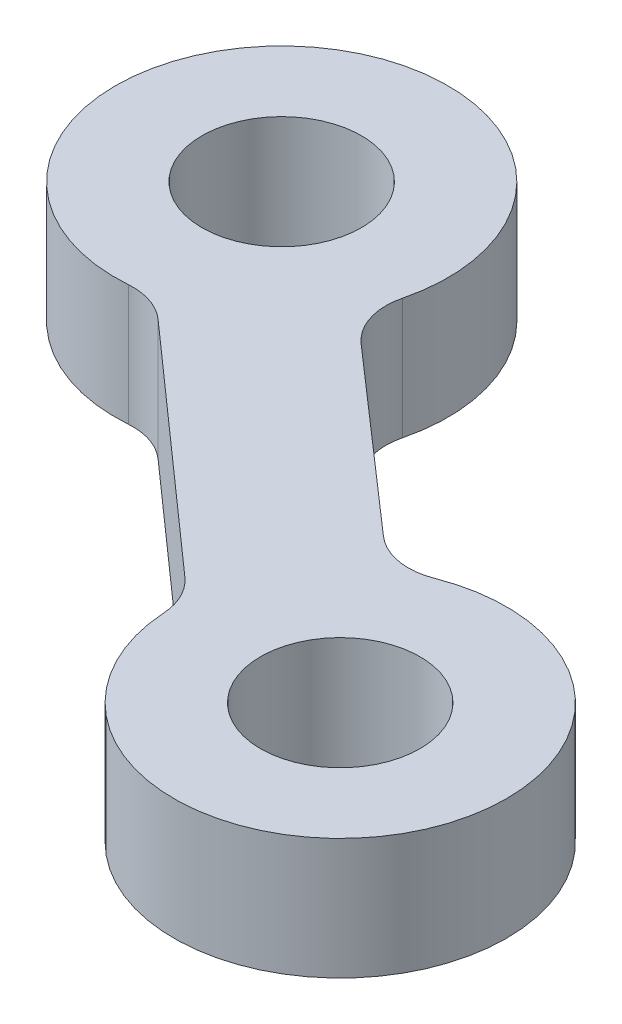
ISO-10303-21;
HEADER;
FILE_DESCRIPTION(('STEP AP214'),'2;1');
FILE_NAME('part.step','',(''),(''),'','','');
FILE_SCHEMA(('AUTOMOTIVE_DESIGN { 1 0 10303 214 1 1 1 1 }'));
ENDSEC;
DATA;
#1=APPLICATION_CONTEXT('core data for automotive mechanical design processes');
#2=APPLICATION_PROTOCOL_DEFINITION('international standard','automotive_design',2000,#1);
#3=PRODUCT_CONTEXT('',#1,'mechanical');
#4=PRODUCT('Part','Part','',(#3));
#5=PRODUCT_RELATED_PRODUCT_CATEGORY('part','',(#4));
#6=PRODUCT_DEFINITION_FORMATION('','',#4);
#7=PRODUCT_DEFINITION_CONTEXT('part definition',#1,'design');
#8=PRODUCT_DEFINITION('design','',#6,#7);
#9=PRODUCT_DEFINITION_SHAPE('','',#8);
#10=(LENGTH_UNIT() NAMED_UNIT(*) SI_UNIT(.MILLI.,.METRE.));
#11=(NAMED_UNIT(*) PLANE_ANGLE_UNIT() SI_UNIT($,.RADIAN.));
#12=(NAMED_UNIT(*) SI_UNIT($,.STERADIAN.) SOLID_ANGLE_UNIT());
#13=UNCERTAINTY_MEASURE_WITH_UNIT(LENGTH_MEASURE(1.E-05),#10,'distance_accuracy_value','');
#14=(GEOMETRIC_REPRESENTATION_CONTEXT(3) GLOBAL_UNCERTAINTY_ASSIGNED_CONTEXT((#13)) GLOBAL_UNIT_ASSIGNED_CONTEXT((#10,
#11,#12)) REPRESENTATION_CONTEXT('',''));
#15=CARTESIAN_POINT('',(0.,0.,0.));
#16=DIRECTION('',(0.,0.,1.));
#17=DIRECTION('',(1.,0.,0.));
#18=AXIS2_PLACEMENT_3D('',#15,#16,#17);
#19=CARTESIAN_POINT('',(97.9868806190565,4.,-33.5833584269257));
#20=DIRECTION('',(0.,-1.,0.));
#21=DIRECTION('',(0.,0.,-1.));
#22=AXIS2_PLACEMENT_3D('',#19,#20,#21);
#23=CYLINDRICAL_SURFACE('',#22,5.50000000000001);
#24=CARTESIAN_POINT('',(97.9868806190565,0.,-33.5833584269257));
#25=DIRECTION('',(0.,-1.,0.));
#26=DIRECTION('',(0.,0.,-1.));
#27=AXIS2_PLACEMENT_3D('',#24,#25,#26);
#28=CIRCLE('',#27,5.50000000000001);
#29=CARTESIAN_POINT('',(95.9828217037036,0.,-38.7052475182468));
#30=VERTEX_POINT('',#29);
#31=CARTESIAN_POINT('',(92.4979516243383,0.,-33.2345626543851));
#32=VERTEX_POINT('',#31);
#33=EDGE_CURVE('E129',#30,#32,#28,.T.);
#34=ORIENTED_EDGE('',*,*,#33,.F.);
#35=DIRECTION('',(0.,-1.,0.));
#36=VECTOR('',#35,1.);
#37=CARTESIAN_POINT('',(95.9828217037036,4.,-38.7052475182468));
#38=LINE('',#37,#36);
#39=CARTESIAN_POINT('',(95.9828217037036,4.,-38.7052475182468));
#40=VERTEX_POINT('',#39);
#41=EDGE_CURVE('E11',#40,#30,#38,.T.);
#42=ORIENTED_EDGE('',*,*,#41,.F.);
#43=CARTESIAN_POINT('',(97.9868806190565,4.,-33.5833584269257));
#44=DIRECTION('',(0.,-1.,0.));
#45=DIRECTION('',(0.,0.,-1.));
#46=AXIS2_PLACEMENT_3D('',#43,#44,#45);
#47=CIRCLE('',#46,5.50000000000001);
#48=CARTESIAN_POINT('',(92.4979516243383,4.,-33.2345626543851));
#49=VERTEX_POINT('',#48);
#50=EDGE_CURVE('E150',#40,#49,#47,.T.);
#51=ORIENTED_EDGE('',*,*,#50,.T.);
#52=DIRECTION('',(0.,-1.,0.));
#53=VECTOR('',#52,1.);
#54=CARTESIAN_POINT('',(92.4979516243383,4.,-33.2345626543851));
#55=LINE('',#54,#53);
#56=EDGE_CURVE('E35',#49,#32,#55,.T.);
#57=ORIENTED_EDGE('',*,*,#56,.T.);
#58=EDGE_LOOP('',(#34,#42,#51,#57));
#59=FACE_BOUND('',#58,.T.);
#60=ADVANCED_FACE('F32',(#59),#23,.T.);
#61=CARTESIAN_POINT('',(95.2540730072116,4.,-40.5677526423636));
#62=DIRECTION('',(0.,-1.,0.));
#63=DIRECTION('',(0.,0.,-1.));
#64=AXIS2_PLACEMENT_3D('',#61,#62,#63);
#65=CYLINDRICAL_SURFACE('',#64,2.00000000000001);
#66=CARTESIAN_POINT('',(95.2540730072116,0.,-40.5677526423636));
#67=DIRECTION('',(0.,1.,0.));
#68=DIRECTION('',(0.,0.,1.));
#69=AXIS2_PLACEMENT_3D('',#66,#67,#68);
#70=CIRCLE('',#69,2.00000000000001);
#71=CARTESIAN_POINT('',(93.9374818242984,0.,-39.0622335767005));
#72=VERTEX_POINT('',#71);
#73=EDGE_CURVE('E148',#72,#30,#70,.T.);
#74=ORIENTED_EDGE('',*,*,#73,.F.);
#75=DIRECTION('',(0.,-1.,0.));
#76=VECTOR('',#75,1.);
#77=CARTESIAN_POINT('',(93.9374818242984,4.,-39.0622335767005));
#78=LINE('',#77,#76);
#79=CARTESIAN_POINT('',(93.9374818242984,4.,-39.0622335767005));
#80=VERTEX_POINT('',#79);
#81=EDGE_CURVE('E41',#80,#72,#78,.T.);
#82=ORIENTED_EDGE('',*,*,#81,.F.);
#83=CARTESIAN_POINT('',(95.2540730072116,4.,-40.5677526423636));
#84=DIRECTION('',(0.,1.,0.));
#85=DIRECTION('',(0.,0.,1.));
#86=AXIS2_PLACEMENT_3D('',#83,#84,#85);
#87=CIRCLE('',#86,2.00000000000001);
#88=EDGE_CURVE('E119',#80,#40,#87,.T.);
#89=ORIENTED_EDGE('',*,*,#88,.T.);
#90=ORIENTED_EDGE('',*,*,#41,.T.);
#91=EDGE_LOOP('',(#74,#82,#89,#90));
#92=FACE_BOUND('',#91,.T.);
#93=ADVANCED_FACE('F162',(#92),#65,.F.);
#94=CARTESIAN_POINT('',(88.0534392912902,4.,-44.2078864585077));
#95=DIRECTION('',(0.658295591456619,0.,-0.752759532831555));
#96=DIRECTION('',(-0.752759532831555,0.,-0.658295591456619));
#97=AXIS2_PLACEMENT_3D('',#94,#95,#96);
#98=PLANE('',#97);
#99=DIRECTION('',(0.752759532831555,0.,0.658295591456619));
#100=VECTOR('',#99,1.);
#101=CARTESIAN_POINT('',(88.0534392912902,0.,-44.2078864585077));
#102=LINE('',#101,#100);
#103=CARTESIAN_POINT('',(88.0534392912902,0.,-44.2078864585077));
#104=VERTEX_POINT('',#103);
#105=EDGE_CURVE('E106',#104,#72,#102,.T.);
#106=ORIENTED_EDGE('',*,*,#105,.F.);
#107=DIRECTION('',(0.,-1.,0.));
#108=VECTOR('',#107,1.);
#109=CARTESIAN_POINT('',(88.0534392912902,4.,-44.2078864585077));
#110=LINE('',#109,#108);
#111=CARTESIAN_POINT('',(88.0534392912902,4.,-44.2078864585077));
#112=VERTEX_POINT('',#111);
#113=EDGE_CURVE('E101',#112,#104,#110,.T.);
#114=ORIENTED_EDGE('',*,*,#113,.F.);
#115=DIRECTION('',(0.752759532831555,0.,0.658295591456619));
#116=VECTOR('',#115,1.);
#117=CARTESIAN_POINT('',(88.0534392912902,4.,-44.2078864585077));
#118=LINE('',#117,#116);
#119=EDGE_CURVE('E104',#112,#80,#118,.T.);
#120=ORIENTED_EDGE('',*,*,#119,.T.);
#121=ORIENTED_EDGE('',*,*,#81,.T.);
#122=EDGE_LOOP('',(#106,#114,#120,#121));
#123=FACE_BOUND('',#122,.T.);
#124=ADVANCED_FACE('F103',(#123),#98,.T.);
#125=CARTESIAN_POINT('',(89.3700304742034,4.,-45.7134055241708));
#126=DIRECTION('',(0.,-1.,0.));
#127=DIRECTION('',(0.,0.,-1.));
#128=AXIS2_PLACEMENT_3D('',#125,#126,#127);
#129=CYLINDRICAL_SURFACE('',#128,2.);
#130=CARTESIAN_POINT('',(89.3700304742034,0.,-45.7134055241708));
#131=DIRECTION('',(0.,1.,0.));
#132=DIRECTION('',(0.,0.,1.));
#133=AXIS2_PLACEMENT_3D('',#130,#131,#132);
#134=CIRCLE('',#133,2.);
#135=CARTESIAN_POINT('',(87.4301696317101,0.,-46.2001702638152));
#136=VERTEX_POINT('',#135);
#137=EDGE_CURVE('E145',#136,#104,#134,.T.);
#138=ORIENTED_EDGE('',*,*,#137,.F.);
#139=DIRECTION('',(0.,-1.,0.));
#140=VECTOR('',#139,1.);
#141=CARTESIAN_POINT('',(87.4301696317101,4.,-46.2001702638152));
#142=LINE('',#141,#140);
#143=CARTESIAN_POINT('',(87.4301696317101,4.,-46.2001702638152));
#144=VERTEX_POINT('',#143);
#145=EDGE_CURVE('E111',#144,#136,#142,.T.);
#146=ORIENTED_EDGE('',*,*,#145,.F.);
#147=CARTESIAN_POINT('',(89.3700304742034,4.,-45.7134055241708));
#148=DIRECTION('',(0.,1.,0.));
#149=DIRECTION('',(0.,0.,1.));
#150=AXIS2_PLACEMENT_3D('',#147,#148,#149);
#151=CIRCLE('',#150,2.);
#152=EDGE_CURVE('E117',#144,#112,#151,.T.);
#153=ORIENTED_EDGE('',*,*,#152,.T.);
#154=ORIENTED_EDGE('',*,*,#113,.T.);
#155=EDGE_LOOP('',(#138,#146,#153,#154));
#156=FACE_BOUND('',#155,.T.);
#157=ADVANCED_FACE('F121',(#156),#129,.F.);
#158=CARTESIAN_POINT('',(82.0955523148534,4.,-47.5387732978373));
#159=DIRECTION('',(0.,-1.,0.));
#160=DIRECTION('',(0.,0.,-1.));
#161=AXIS2_PLACEMENT_3D('',#158,#159,#160);
#162=CYLINDRICAL_SURFACE('',#161,5.50000000000001);
#163=CARTESIAN_POINT('',(82.0955523148534,0.,-47.5387732978373));
#164=DIRECTION('',(0.,-1.,0.));
#165=DIRECTION('',(0.,0.,-1.));
#166=AXIS2_PLACEMENT_3D('',#163,#164,#165);
#167=CIRCLE('',#166,5.50000000000001);
#168=CARTESIAN_POINT('',(82.5101698124519,0.,-42.0544235341292));
#169=VERTEX_POINT('',#168);
#170=EDGE_CURVE('E142',#169,#136,#167,.T.);
#171=ORIENTED_EDGE('',*,*,#170,.F.);
#172=DIRECTION('',(0.,-1.,0.));
#173=VECTOR('',#172,1.);
#174=CARTESIAN_POINT('',(82.5101698124519,4.,-42.0544235341292));
#175=LINE('',#174,#173);
#176=CARTESIAN_POINT('',(82.5101698124519,4.,-42.0544235341292));
#177=VERTEX_POINT('',#176);
#178=EDGE_CURVE('E154',#177,#169,#175,.T.);
#179=ORIENTED_EDGE('',*,*,#178,.F.);
#180=CARTESIAN_POINT('',(82.0955523148534,4.,-47.5387732978373));
#181=DIRECTION('',(0.,-1.,0.));
#182=DIRECTION('',(0.,0.,-1.));
#183=AXIS2_PLACEMENT_3D('',#180,#181,#182);
#184=CIRCLE('',#183,5.50000000000001);
#185=EDGE_CURVE('E122',#177,#144,#184,.T.);
#186=ORIENTED_EDGE('',*,*,#185,.T.);
#187=ORIENTED_EDGE('',*,*,#145,.T.);
#188=EDGE_LOOP('',(#171,#179,#186,#187));
#189=FACE_BOUND('',#188,.T.);
#190=ADVANCED_FACE('F175',(#189),#162,.T.);
#191=CARTESIAN_POINT('',(82.6609398115787,4.,-40.0601145291444));
#192=DIRECTION('',(0.,-1.,0.));
#193=DIRECTION('',(0.,0.,-1.));
#194=AXIS2_PLACEMENT_3D('',#191,#192,#193);
#195=CYLINDRICAL_SURFACE('',#194,2.);
#196=CARTESIAN_POINT('',(82.6609398115787,0.,-40.0601145291444));
#197=DIRECTION('',(0.,1.,0.));
#198=DIRECTION('',(0.,0.,1.));
#199=AXIS2_PLACEMENT_3D('',#196,#197,#198);
#200=CIRCLE('',#199,2.);
#201=CARTESIAN_POINT('',(83.9878087778209,0.,-41.5565832880643));
#202=VERTEX_POINT('',#201);
#203=EDGE_CURVE('E139',#202,#169,#200,.T.);
#204=ORIENTED_EDGE('',*,*,#203,.F.);
#205=DIRECTION('',(0.,-1.,0.));
#206=VECTOR('',#205,1.);
#207=CARTESIAN_POINT('',(83.9878087778209,4.,-41.5565832880643));
#208=LINE('',#207,#206);
#209=CARTESIAN_POINT('',(83.9878087778209,4.,-41.5565832880643));
#210=VERTEX_POINT('',#209);
#211=EDGE_CURVE('E156',#210,#202,#208,.T.);
#212=ORIENTED_EDGE('',*,*,#211,.F.);
#213=CARTESIAN_POINT('',(82.6609398115787,4.,-40.0601145291444));
#214=DIRECTION('',(0.,1.,0.));
#215=DIRECTION('',(0.,0.,1.));
#216=AXIS2_PLACEMENT_3D('',#213,#214,#215);
#217=CIRCLE('',#216,2.);
#218=EDGE_CURVE('E124',#210,#177,#217,.T.);
#219=ORIENTED_EDGE('',*,*,#218,.T.);
#220=ORIENTED_EDGE('',*,*,#178,.T.);
#221=EDGE_LOOP('',(#204,#212,#219,#220));
#222=FACE_BOUND('',#221,.T.);
#223=ADVANCED_FACE('F178',(#222),#195,.F.);
#224=CARTESIAN_POINT('',(91.8288464106831,4.,-34.6041965869265));
#225=DIRECTION('',(-0.66343448312114,0.,0.748234379459929));
#226=DIRECTION('',(0.748234379459929,0.,0.66343448312114));
#227=AXIS2_PLACEMENT_3D('',#224,#225,#226);
#228=PLANE('',#227);
#229=DIRECTION('',(-0.748234379459929,0.,-0.66343448312114));
#230=VECTOR('',#229,1.);
#231=CARTESIAN_POINT('',(91.8288464106831,0.,-34.6041965869265));
#232=LINE('',#231,#230);
#233=CARTESIAN_POINT('',(91.8288464106831,0.,-34.6041965869265));
#234=VERTEX_POINT('',#233);
#235=EDGE_CURVE('E136',#234,#202,#232,.T.);
#236=ORIENTED_EDGE('',*,*,#235,.F.);
#237=DIRECTION('',(0.,-1.,0.));
#238=VECTOR('',#237,1.);
#239=CARTESIAN_POINT('',(91.8288464106831,4.,-34.6041965869265));
#240=LINE('',#239,#238);
#241=CARTESIAN_POINT('',(91.8288464106831,4.,-34.6041965869265));
#242=VERTEX_POINT('',#241);
#243=EDGE_CURVE('E157',#242,#234,#240,.T.);
#244=ORIENTED_EDGE('',*,*,#243,.F.);
#245=DIRECTION('',(-0.748234379459929,0.,-0.66343448312114));
#246=VECTOR('',#245,1.);
#247=CARTESIAN_POINT('',(91.8288464106831,4.,-34.6041965869265));
#248=LINE('',#247,#246);
#249=EDGE_CURVE('E224',#242,#210,#248,.T.);
#250=ORIENTED_EDGE('',*,*,#249,.T.);
#251=ORIENTED_EDGE('',*,*,#211,.T.);
#252=EDGE_LOOP('',(#236,#244,#250,#251));
#253=FACE_BOUND('',#252,.T.);
#254=ADVANCED_FACE('F182',(#253),#228,.T.);
#255=CARTESIAN_POINT('',(90.5019774444408,4.,-33.1077278280066));
#256=DIRECTION('',(0.,-1.,0.));
#257=DIRECTION('',(0.,0.,-1.));
#258=AXIS2_PLACEMENT_3D('',#255,#256,#257);
#259=CYLINDRICAL_SURFACE('',#258,2.00000000000001);
#260=CARTESIAN_POINT('',(90.5019774444408,0.,-33.1077278280066));
#261=DIRECTION('',(0.,1.,0.));
#262=DIRECTION('',(0.,0.,1.));
#263=AXIS2_PLACEMENT_3D('',#260,#261,#262);
#264=CIRCLE('',#263,2.00000000000001);
#265=EDGE_CURVE('E132',#32,#234,#264,.T.);
#266=ORIENTED_EDGE('',*,*,#265,.F.);
#267=ORIENTED_EDGE('',*,*,#56,.F.);
#268=CARTESIAN_POINT('',(90.5019774444408,4.,-33.1077278280066));
#269=DIRECTION('',(0.,1.,0.));
#270=DIRECTION('',(0.,0.,1.));
#271=AXIS2_PLACEMENT_3D('',#268,#269,#270);
#272=CIRCLE('',#271,2.00000000000001);
#273=EDGE_CURVE('E222',#49,#242,#272,.T.);
#274=ORIENTED_EDGE('',*,*,#273,.T.);
#275=ORIENTED_EDGE('',*,*,#243,.T.);
#276=EDGE_LOOP('',(#266,#267,#274,#275));
#277=FACE_BOUND('',#276,.T.);
#278=ADVANCED_FACE('F159',(#277),#259,.F.);
#279=CARTESIAN_POINT('',(97.9868806190565,4.,-33.5833584269257));
#280=DIRECTION('',(0.,-1.,0.));
#281=DIRECTION('',(0.,0.,-1.));
#282=AXIS2_PLACEMENT_3D('',#279,#280,#281);
#283=PLANE('',#282);
#284=CARTESIAN_POINT('',(97.9868806190565,4.,-33.5833584269257));
#285=DIRECTION('',(0.,-1.,0.));
#286=DIRECTION('',(0.,0.,1.));
#287=AXIS2_PLACEMENT_3D('',#284,#285,#286);
#288=CIRCLE('',#287,2.63749999999999);
#289=CARTESIAN_POINT('',(97.9868806190565,4.,-30.9458584269257));
#290=VERTEX_POINT('',#289);
#291=EDGE_CURVE('E209',#290,#290,#288,.T.);
#292=ORIENTED_EDGE('',*,*,#291,.T.);
#293=EDGE_LOOP('',(#292));
#294=FACE_BOUND('',#293,.T.);
#295=CARTESIAN_POINT('',(82.0955523148534,4.,-47.5387732978373));
#296=DIRECTION('',(0.,-1.,0.));
#297=DIRECTION('',(0.,0.,1.));
#298=AXIS2_PLACEMENT_3D('',#295,#296,#297);
#299=CIRCLE('',#298,2.63750000000001);
#300=CARTESIAN_POINT('',(82.0955523148534,4.,-44.9012732978373));
#301=VERTEX_POINT('',#300);
#302=EDGE_CURVE('E133',#301,#301,#299,.T.);
#303=ORIENTED_EDGE('',*,*,#302,.T.);
#304=EDGE_LOOP('',(#303));
#305=FACE_BOUND('',#304,.T.);
#306=ORIENTED_EDGE('',*,*,#50,.F.);
#307=ORIENTED_EDGE('',*,*,#88,.F.);
#308=ORIENTED_EDGE('',*,*,#119,.F.);
#309=ORIENTED_EDGE('',*,*,#152,.F.);
#310=ORIENTED_EDGE('',*,*,#185,.F.);
#311=ORIENTED_EDGE('',*,*,#218,.F.);
#312=ORIENTED_EDGE('',*,*,#249,.F.);
#313=ORIENTED_EDGE('',*,*,#273,.F.);
#314=EDGE_LOOP('',(#306,#307,#308,#309,#310,#311,#312,#313));
#315=FACE_BOUND('',#314,.T.);
#316=ADVANCED_FACE('F115',(#294,#305,#315),#283,.F.);
#317=CARTESIAN_POINT('',(97.9868806190565,0.,-33.5833584269257));
#318=DIRECTION('',(0.,-1.,0.));
#319=DIRECTION('',(0.,0.,-1.));
#320=AXIS2_PLACEMENT_3D('',#317,#318,#319);
#321=PLANE('',#320);
#322=CARTESIAN_POINT('',(97.9868806190565,0.,-33.5833584269257));
#323=DIRECTION('',(0.,-1.,0.));
#324=DIRECTION('',(0.,0.,1.));
#325=AXIS2_PLACEMENT_3D('',#322,#323,#324);
#326=CIRCLE('',#325,2.63749999999999);
#327=CARTESIAN_POINT('',(97.9868806190565,0.,-30.9458584269257));
#328=VERTEX_POINT('',#327);
#329=EDGE_CURVE('E212',#328,#328,#326,.T.);
#330=ORIENTED_EDGE('',*,*,#329,.F.);
#331=EDGE_LOOP('',(#330));
#332=FACE_BOUND('',#331,.T.);
#333=CARTESIAN_POINT('',(82.0955523148534,0.,-47.5387732978373));
#334=DIRECTION('',(0.,-1.,0.));
#335=DIRECTION('',(0.,0.,1.));
#336=AXIS2_PLACEMENT_3D('',#333,#334,#335);
#337=CIRCLE('',#336,2.63750000000001);
#338=CARTESIAN_POINT('',(82.0955523148534,0.,-44.9012732978373));
#339=VERTEX_POINT('',#338);
#340=EDGE_CURVE('E214',#339,#339,#337,.T.);
#341=ORIENTED_EDGE('',*,*,#340,.F.);
#342=EDGE_LOOP('',(#341));
#343=FACE_BOUND('',#342,.T.);
#344=ORIENTED_EDGE('',*,*,#33,.T.);
#345=ORIENTED_EDGE('',*,*,#265,.T.);
#346=ORIENTED_EDGE('',*,*,#235,.T.);
#347=ORIENTED_EDGE('',*,*,#203,.T.);
#348=ORIENTED_EDGE('',*,*,#170,.T.);
#349=ORIENTED_EDGE('',*,*,#137,.T.);
#350=ORIENTED_EDGE('',*,*,#105,.T.);
#351=ORIENTED_EDGE('',*,*,#73,.T.);
#352=EDGE_LOOP('',(#344,#345,#346,#347,#348,#349,#350,#351));
#353=FACE_BOUND('',#352,.T.);
#354=ADVANCED_FACE('F161',(#332,#343,#353),#321,.T.);
#355=CARTESIAN_POINT('',(82.0955523148534,4.,-47.5387732978373));
#356=DIRECTION('',(0.,-1.,0.));
#357=DIRECTION('',(0.,0.,-1.));
#358=AXIS2_PLACEMENT_3D('',#355,#356,#357);
#359=CYLINDRICAL_SURFACE('',#358,2.63750000000001);
#360=ORIENTED_EDGE('',*,*,#302,.F.);
#361=EDGE_LOOP('',(#360));
#362=FACE_BOUND('',#361,.T.);
#363=ORIENTED_EDGE('',*,*,#340,.T.);
#364=EDGE_LOOP('',(#363));
#365=FACE_BOUND('',#364,.T.);
#366=ADVANCED_FACE('F194',(#362,#365),#359,.F.);
#367=CARTESIAN_POINT('',(97.9868806190565,4.,-33.5833584269257));
#368=DIRECTION('',(0.,-1.,0.));
#369=DIRECTION('',(0.,0.,-1.));
#370=AXIS2_PLACEMENT_3D('',#367,#368,#369);
#371=CYLINDRICAL_SURFACE('',#370,2.63749999999999);
#372=ORIENTED_EDGE('',*,*,#291,.F.);
#373=EDGE_LOOP('',(#372));
#374=FACE_BOUND('',#373,.T.);
#375=ORIENTED_EDGE('',*,*,#329,.T.);
#376=EDGE_LOOP('',(#375));
#377=FACE_BOUND('',#376,.T.);
#378=ADVANCED_FACE('F201',(#374,#377),#371,.F.);
#379=CLOSED_SHELL('',(#60,#93,#124,#157,#190,#223,#254,#278,#316,#354,#366,#378));
#380=MANIFOLD_SOLID_BREP('B2',#379);
#381=ADVANCED_BREP_SHAPE_REPRESENTATION('',(#18,#380),#14);
#382=SHAPE_DEFINITION_REPRESENTATION(#9,#381);
ENDSEC;
END-ISO-10303-21;
